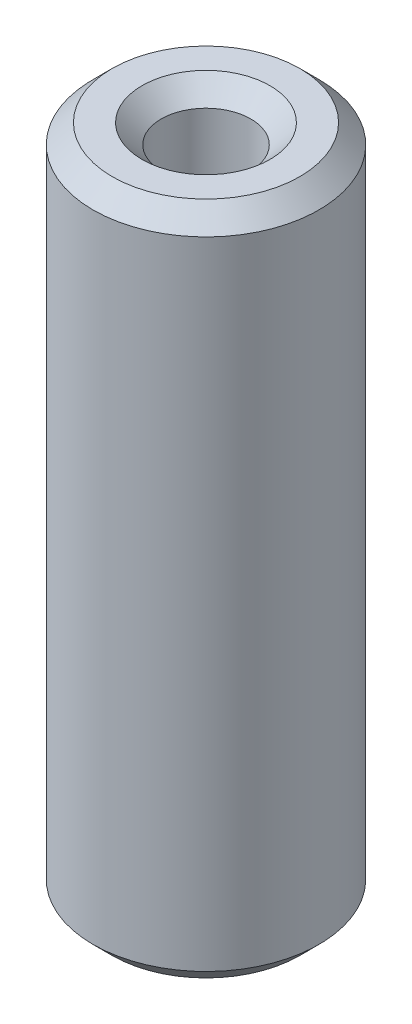
ISO-10303-21;
HEADER;
FILE_DESCRIPTION(('STEP AP214'),'2;1');
FILE_NAME('part.step','',(''),(''),'','','');
FILE_SCHEMA(('AUTOMOTIVE_DESIGN { 1 0 10303 214 1 1 1 1 }'));
ENDSEC;
DATA;
#1=APPLICATION_CONTEXT('core data for automotive mechanical design processes');
#2=APPLICATION_PROTOCOL_DEFINITION('international standard','automotive_design',2000,#1);
#3=PRODUCT_CONTEXT('',#1,'mechanical');
#4=PRODUCT('Part','Part','',(#3));
#5=PRODUCT_RELATED_PRODUCT_CATEGORY('part','',(#4));
#6=PRODUCT_DEFINITION_FORMATION('','',#4);
#7=PRODUCT_DEFINITION_CONTEXT('part definition',#1,'design');
#8=PRODUCT_DEFINITION('design','',#6,#7);
#9=PRODUCT_DEFINITION_SHAPE('','',#8);
#10=(LENGTH_UNIT() NAMED_UNIT(*) SI_UNIT(.MILLI.,.METRE.));
#11=(NAMED_UNIT(*) PLANE_ANGLE_UNIT() SI_UNIT($,.RADIAN.));
#12=(NAMED_UNIT(*) SI_UNIT($,.STERADIAN.) SOLID_ANGLE_UNIT());
#13=UNCERTAINTY_MEASURE_WITH_UNIT(LENGTH_MEASURE(1.E-05),#10,'distance_accuracy_value','');
#14=(GEOMETRIC_REPRESENTATION_CONTEXT(3) GLOBAL_UNCERTAINTY_ASSIGNED_CONTEXT((#13)) GLOBAL_UNIT_ASSIGNED_CONTEXT((#10,
#11,#12)) REPRESENTATION_CONTEXT('',''));
#15=CARTESIAN_POINT('',(0.,0.,0.));
#16=DIRECTION('',(0.,0.,1.));
#17=DIRECTION('',(1.,0.,0.));
#18=AXIS2_PLACEMENT_3D('',#15,#16,#17);
#19=CARTESIAN_POINT('',(0.,119.429175791816,0.));
#20=DIRECTION('',(0.,-1.,0.));
#21=DIRECTION('',(0.,0.,-1.));
#22=AXIS2_PLACEMENT_3D('',#19,#20,#21);
#23=CYLINDRICAL_SURFACE('',#22,20.);
#24=CARTESIAN_POINT('',(0.,3.39939485888244,0.));
#25=DIRECTION('',(0.,1.,0.));
#26=DIRECTION('',(0.,0.,1.));
#27=AXIS2_PLACEMENT_3D('',#24,#25,#26);
#28=CIRCLE('',#27,20.);
#29=CARTESIAN_POINT('',(0.,3.39939485888244,20.));
#30=VERTEX_POINT('',#29);
#31=EDGE_CURVE('E10',#30,#30,#28,.T.);
#32=ORIENTED_EDGE('',*,*,#31,.T.);
#33=EDGE_LOOP('',(#32));
#34=FACE_BOUND('',#33,.T.);
#35=CARTESIAN_POINT('',(0.,116.029780932933,0.));
#36=DIRECTION('',(0.,1.,0.));
#37=DIRECTION('',(0.,0.,1.));
#38=AXIS2_PLACEMENT_3D('',#35,#36,#37);
#39=CIRCLE('',#38,20.);
#40=CARTESIAN_POINT('',(0.,116.029780932933,-20.));
#41=VERTEX_POINT('',#40);
#42=EDGE_CURVE('E50',#41,#41,#39,.F.);
#43=ORIENTED_EDGE('',*,*,#42,.T.);
#44=EDGE_LOOP('',(#43));
#45=FACE_BOUND('',#44,.T.);
#46=ADVANCED_FACE('F39',(#34,#45),#23,.T.);
#47=CARTESIAN_POINT('',(0.,119.429175791816,0.));
#48=DIRECTION('',(0.,1.,0.));
#49=DIRECTION('',(0.,0.,1.));
#50=AXIS2_PLACEMENT_3D('',#47,#48,#49);
#51=PLANE('',#50);
#52=CARTESIAN_POINT('',(0.,119.429175791816,0.));
#53=DIRECTION('',(0.,1.,0.));
#54=DIRECTION('',(0.,0.,1.));
#55=AXIS2_PLACEMENT_3D('',#52,#53,#54);
#56=CIRCLE('',#55,11.3262238716489);
#57=CARTESIAN_POINT('',(0.,119.429175791816,11.3262238716489));
#58=VERTEX_POINT('',#57);
#59=EDGE_CURVE('E58',#58,#58,#56,.F.);
#60=ORIENTED_EDGE('',*,*,#59,.T.);
#61=EDGE_LOOP('',(#60));
#62=FACE_BOUND('',#61,.T.);
#63=CARTESIAN_POINT('',(0.,119.429175791816,0.));
#64=DIRECTION('',(0.,1.,0.));
#65=DIRECTION('',(0.,0.,1.));
#66=AXIS2_PLACEMENT_3D('',#63,#64,#65);
#67=CIRCLE('',#66,16.6006051411176);
#68=CARTESIAN_POINT('',(0.,119.429175791816,-16.6006051411176));
#69=VERTEX_POINT('',#68);
#70=EDGE_CURVE('E61',#69,#69,#67,.T.);
#71=ORIENTED_EDGE('',*,*,#70,.T.);
#72=EDGE_LOOP('',(#71));
#73=FACE_BOUND('',#72,.T.);
#74=ADVANCED_FACE('F88',(#62,#73),#51,.T.);
#75=CARTESIAN_POINT('',(0.,0.,0.));
#76=DIRECTION('',(0.,1.,0.));
#77=DIRECTION('',(0.,0.,1.));
#78=AXIS2_PLACEMENT_3D('',#75,#76,#77);
#79=PLANE('',#78);
#80=CARTESIAN_POINT('',(0.,0.,0.));
#81=DIRECTION('',(0.,1.,0.));
#82=DIRECTION('',(0.,0.,1.));
#83=AXIS2_PLACEMENT_3D('',#80,#81,#82);
#84=CIRCLE('',#83,11.3262238716489);
#85=CARTESIAN_POINT('',(0.,0.,11.3262238716489));
#86=VERTEX_POINT('',#85);
#87=EDGE_CURVE('E51',#86,#86,#84,.T.);
#88=ORIENTED_EDGE('',*,*,#87,.T.);
#89=EDGE_LOOP('',(#88));
#90=FACE_BOUND('',#89,.T.);
#91=CARTESIAN_POINT('',(0.,0.,0.));
#92=DIRECTION('',(0.,1.,0.));
#93=DIRECTION('',(0.,0.,1.));
#94=AXIS2_PLACEMENT_3D('',#91,#92,#93);
#95=CIRCLE('',#94,16.6006051411175);
#96=CARTESIAN_POINT('',(0.,0.,16.6006051411175));
#97=VERTEX_POINT('',#96);
#98=EDGE_CURVE('E54',#97,#97,#95,.F.);
#99=ORIENTED_EDGE('',*,*,#98,.T.);
#100=EDGE_LOOP('',(#99));
#101=FACE_BOUND('',#100,.T.);
#102=ADVANCED_FACE('F83',(#90,#101),#79,.F.);
#103=CARTESIAN_POINT('',(0.,119.429175791816,0.));
#104=DIRECTION('',(0.,-1.,0.));
#105=DIRECTION('',(0.,0.,-1.));
#106=AXIS2_PLACEMENT_3D('',#103,#104,#105);
#107=CYLINDRICAL_SURFACE('',#106,7.9268290127665);
#108=CARTESIAN_POINT('',(0.,116.029780932934,0.));
#109=DIRECTION('',(0.,1.,0.));
#110=DIRECTION('',(0.,0.,1.));
#111=AXIS2_PLACEMENT_3D('',#108,#109,#110);
#112=CIRCLE('',#111,7.9268290127665);
#113=CARTESIAN_POINT('',(0.,116.029780932934,7.9268290127665));
#114=VERTEX_POINT('',#113);
#115=EDGE_CURVE('E67',#114,#114,#112,.T.);
#116=ORIENTED_EDGE('',*,*,#115,.T.);
#117=EDGE_LOOP('',(#116));
#118=FACE_BOUND('',#117,.T.);
#119=CARTESIAN_POINT('',(0.,3.39939485888244,0.));
#120=DIRECTION('',(0.,1.,0.));
#121=DIRECTION('',(0.,0.,1.));
#122=AXIS2_PLACEMENT_3D('',#119,#120,#121);
#123=CIRCLE('',#122,7.9268290127665);
#124=CARTESIAN_POINT('',(0.,3.39939485888244,7.9268290127665));
#125=VERTEX_POINT('',#124);
#126=EDGE_CURVE('E69',#125,#125,#123,.F.);
#127=ORIENTED_EDGE('',*,*,#126,.T.);
#128=EDGE_LOOP('',(#127));
#129=FACE_BOUND('',#128,.T.);
#130=ADVANCED_FACE('F71',(#118,#129),#107,.F.);
#131=CARTESIAN_POINT('',(0.,116.029780932934,0.));
#132=DIRECTION('',(0.,1.,0.));
#133=DIRECTION('',(0.,0.,1.));
#134=AXIS2_PLACEMENT_3D('',#131,#132,#133);
#135=CONICAL_SURFACE('',#134,7.9268290127665,0.785398163397452);
#136=ORIENTED_EDGE('',*,*,#59,.F.);
#137=EDGE_LOOP('',(#136));
#138=FACE_BOUND('',#137,.T.);
#139=ORIENTED_EDGE('',*,*,#115,.F.);
#140=EDGE_LOOP('',(#139));
#141=FACE_BOUND('',#140,.T.);
#142=ADVANCED_FACE('F77',(#138,#141),#135,.F.);
#143=CARTESIAN_POINT('',(0.,0.,0.));
#144=DIRECTION('',(0.,-1.,0.));
#145=DIRECTION('',(0.,0.,-1.));
#146=AXIS2_PLACEMENT_3D('',#143,#144,#145);
#147=CONICAL_SURFACE('',#146,11.3262238716489,0.785398163397444);
#148=ORIENTED_EDGE('',*,*,#126,.F.);
#149=EDGE_LOOP('',(#148));
#150=FACE_BOUND('',#149,.T.);
#151=ORIENTED_EDGE('',*,*,#87,.F.);
#152=EDGE_LOOP('',(#151));
#153=FACE_BOUND('',#152,.T.);
#154=ADVANCED_FACE('F73',(#150,#153),#147,.F.);
#155=CARTESIAN_POINT('',(0.,3.39939485888244,0.));
#156=DIRECTION('',(0.,1.,0.));
#157=DIRECTION('',(0.,0.,1.));
#158=AXIS2_PLACEMENT_3D('',#155,#156,#157);
#159=CONICAL_SURFACE('',#158,20.,0.785398163397452);
#160=ORIENTED_EDGE('',*,*,#98,.F.);
#161=EDGE_LOOP('',(#160));
#162=FACE_BOUND('',#161,.T.);
#163=ORIENTED_EDGE('',*,*,#31,.F.);
#164=EDGE_LOOP('',(#163));
#165=FACE_BOUND('',#164,.T.);
#166=ADVANCED_FACE('F76',(#162,#165),#159,.T.);
#167=CARTESIAN_POINT('',(0.,119.429175791816,0.));
#168=DIRECTION('',(0.,-1.,0.));
#169=DIRECTION('',(0.,0.,-1.));
#170=AXIS2_PLACEMENT_3D('',#167,#168,#169);
#171=CONICAL_SURFACE('',#170,16.6006051411176,0.785398163397446);
#172=CARTESIAN_POINT('',(0.,116.029780932933,-20.));
#173=CARTESIAN_POINT('',(0.,116.065191296047,-19.9645896368867));
#174=CARTESIAN_POINT('',(0.,116.10060165916,-19.9291792737733));
#175=CARTESIAN_POINT('',(0.,116.171422385387,-19.8583585475466));
#176=CARTESIAN_POINT('',(0.,116.2068327485,-19.8229481844332));
#177=CARTESIAN_POINT('',(0.,116.277653474727,-19.7521274582065));
#178=CARTESIAN_POINT('',(0.,116.31306383784,-19.7167170950931));
#179=CARTESIAN_POINT('',(0.,116.383884564067,-19.6458963688664));
#180=CARTESIAN_POINT('',(0.,116.41929492718,-19.6104860057531));
#181=CARTESIAN_POINT('',(0.,116.490115653407,-19.5396652795263));
#182=CARTESIAN_POINT('',(0.,116.52552601652,-19.504254916413));
#183=CARTESIAN_POINT('',(0.,116.596346742747,-19.4334341901863));
#184=CARTESIAN_POINT('',(0.,116.631757105861,-19.3980238270729));
#185=CARTESIAN_POINT('',(0.,116.702577832087,-19.3272031008462));
#186=CARTESIAN_POINT('',(0.,116.737988195201,-19.2917927377328));
#187=CARTESIAN_POINT('',(0.,116.808808921427,-19.2209720115061));
#188=CARTESIAN_POINT('',(0.,116.844219284541,-19.1855616483928));
#189=CARTESIAN_POINT('',(0.,116.915040010767,-19.114740922166));
#190=CARTESIAN_POINT('',(0.,116.950450373881,-19.0793305590527));
#191=CARTESIAN_POINT('',(0.,117.021271100108,-19.008509832826));
#192=CARTESIAN_POINT('',(0.,117.056681463221,-18.9730994697126));
#193=CARTESIAN_POINT('',(0.,117.127502189448,-18.9022787434859));
#194=CARTESIAN_POINT('',(0.,117.162912552561,-18.8668683803725));
#195=CARTESIAN_POINT('',(0.,117.233733278788,-18.7960476541458));
#196=CARTESIAN_POINT('',(0.,117.269143641901,-18.7606372910324));
#197=CARTESIAN_POINT('',(0.,117.339964368128,-18.6898165648057));
#198=CARTESIAN_POINT('',(0.,117.375374731241,-18.6544062016924));
#199=CARTESIAN_POINT('',(0.,117.446195457468,-18.5835854754657));
#200=CARTESIAN_POINT('',(0.,117.481605820581,-18.5481751123523));
#201=CARTESIAN_POINT('',(0.,117.552426546808,-18.4773543861256));
#202=CARTESIAN_POINT('',(0.,117.587836909921,-18.4419440230122));
#203=CARTESIAN_POINT('',(0.,117.658657636148,-18.3711232967855));
#204=CARTESIAN_POINT('',(0.,117.694067999261,-18.3357129336721));
#205=CARTESIAN_POINT('',(0.,117.764888725488,-18.2648922074454));
#206=CARTESIAN_POINT('',(0.,117.800299088601,-18.2294818443321));
#207=CARTESIAN_POINT('',(0.,117.871119814828,-18.1586611181053));
#208=CARTESIAN_POINT('',(0.,117.906530177941,-18.123250754992));
#209=CARTESIAN_POINT('',(0.,117.977350904168,-18.0524300287653));
#210=CARTESIAN_POINT('',(0.,118.012761267282,-18.0170196656519));
#211=CARTESIAN_POINT('',(0.,118.083581993508,-17.9461989394252));
#212=CARTESIAN_POINT('',(0.,118.118992356622,-17.9107885763118));
#213=CARTESIAN_POINT('',(0.,118.189813082848,-17.8399678500851));
#214=CARTESIAN_POINT('',(0.,118.225223445962,-17.8045574869718));
#215=CARTESIAN_POINT('',(0.,118.296044172188,-17.733736760745));
#216=CARTESIAN_POINT('',(0.,118.331454535302,-17.6983263976317));
#217=CARTESIAN_POINT('',(0.,118.402275261529,-17.627505671405));
#218=CARTESIAN_POINT('',(0.,118.437685624642,-17.5920953082916));
#219=CARTESIAN_POINT('',(0.,118.508506350869,-17.5212745820649));
#220=CARTESIAN_POINT('',(0.,118.543916713982,-17.4858642189515));
#221=CARTESIAN_POINT('',(0.,118.614737440209,-17.4150434927248));
#222=CARTESIAN_POINT('',(0.,118.650147803322,-17.3796331296115));
#223=CARTESIAN_POINT('',(0.,118.720968529549,-17.3088124033847));
#224=CARTESIAN_POINT('',(0.,118.756378892662,-17.2734020402714));
#225=CARTESIAN_POINT('',(0.,118.827199618889,-17.2025813140447));
#226=CARTESIAN_POINT('',(0.,118.862609982002,-17.1671709509313));
#227=CARTESIAN_POINT('',(0.,118.933430708229,-17.0963502247046));
#228=CARTESIAN_POINT('',(0.,118.968841071342,-17.0609398615912));
#229=CARTESIAN_POINT('',(0.,119.039661797569,-16.9901191353645));
#230=CARTESIAN_POINT('',(0.,119.075072160682,-16.9547087722511));
#231=CARTESIAN_POINT('',(0.,119.145892886909,-16.8838880460244));
#232=CARTESIAN_POINT('',(0.,119.181303250022,-16.8484776829111));
#233=CARTESIAN_POINT('',(0.,119.252123976249,-16.7776569566844));
#234=CARTESIAN_POINT('',(0.,119.287534339362,-16.742246593571));
#235=CARTESIAN_POINT('',(0.,119.358355065589,-16.6714258673443));
#236=CARTESIAN_POINT('',(0.,119.393765428703,-16.6360155042309));
#237=CARTESIAN_POINT('',(0.,119.429175791816,-16.6006051411176));
#238=B_SPLINE_CURVE_WITH_KNOTS('',3,(#172,#173,#174,#175,#176,#177,#178,#179,#180,#181,#182,
#183,#184,#185,#186,#187,#188,#189,#190,#191,#192,#193,#194,#195,#196,#197,#198,#199,#200,#201,
#202,#203,#204,#205,#206,#207,#208,#209,#210,#211,#212,#213,#214,#215,#216,#217,#218,#219,#220,
#221,#222,#223,#224,#225,#226,#227,#228,#229,#230,#231,#232,#233,#234,#235,#236,#237),
.UNSPECIFIED.,.F.,.F.,(4,2,2,2,2,2,2,2,2,2,2,2,2,2,2,2,2,2,2,2,2,2,2,2,2,2,2,2,2,2,2,2,4),(0.,
0.150233447290402,0.300466894580807,0.45070034187121,0.600933789161612,0.751167236452017,
0.901400683742419,1.05163413103282,1.20186757832324,1.35210102561364,1.50233447290404,
1.65256792019445,1.80280136748485,1.95303481477525,2.10326826206566,2.25350170935606,
2.40373515664647,2.55396860393687,2.70420205122728,2.85443549851768,3.00466894580808,
3.15490239309849,3.30513584038889,3.45536928767929,3.60560273496971,3.75583618226011,
3.90606962955051,4.05630307684092,4.20653652413132,4.35676997142172,4.50700341871212,
4.65723686600253,4.80747031329294),.UNSPECIFIED.);
#239=EDGE_CURVE('BSEAM45',#41,#69,#238,.T.);
#240=ORIENTED_EDGE('',*,*,#42,.F.);
#241=ORIENTED_EDGE('',*,*,#70,.F.);
#242=ORIENTED_EDGE('',*,*,#239,.T.);
#243=ORIENTED_EDGE('',*,*,#239,.F.);
#244=EDGE_LOOP('',(#240,#242,#241,#243));
#245=FACE_BOUND('',#244,.T.);
#246=ADVANCED_FACE('F45',(#245),#171,.T.);
#247=CLOSED_SHELL('',(#46,#74,#102,#130,#142,#154,#166,#246));
#248=MANIFOLD_SOLID_BREP('B2',#247);
#249=ADVANCED_BREP_SHAPE_REPRESENTATION('',(#18,#248),#14);
#250=SHAPE_DEFINITION_REPRESENTATION(#9,#249);
ENDSEC;
END-ISO-10303-21;
